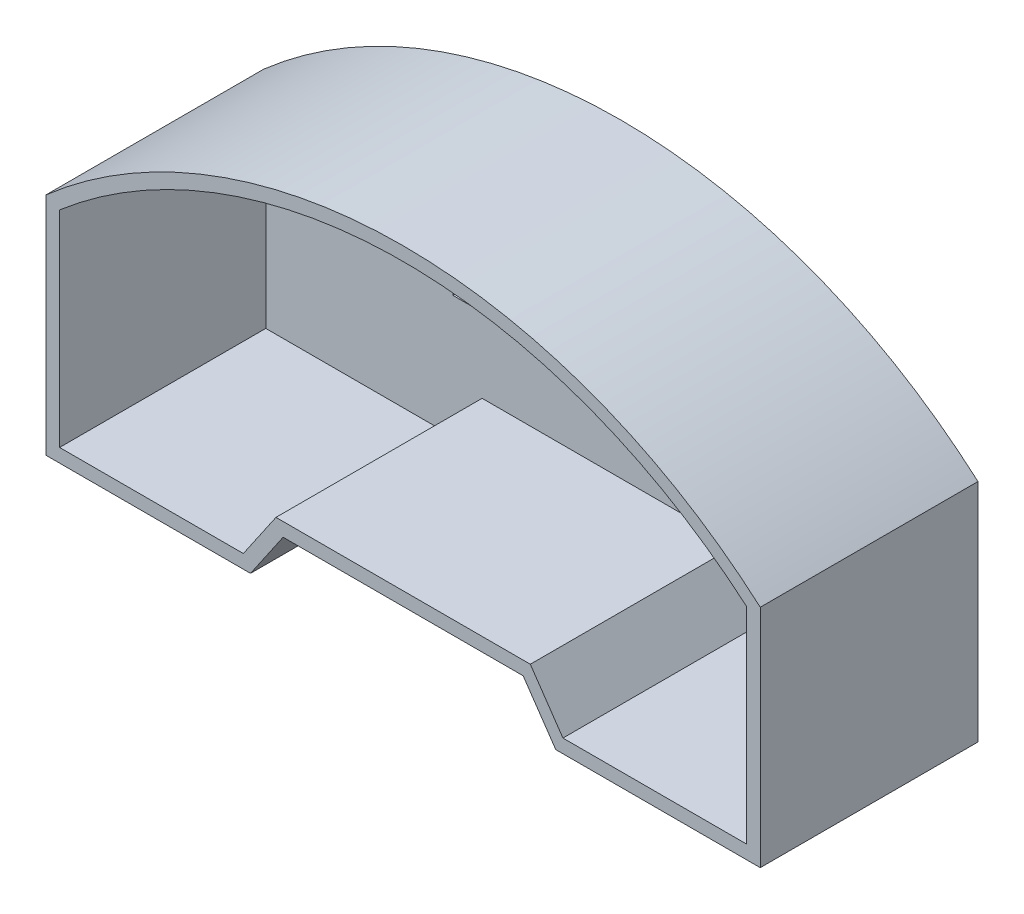
ISO-10303-21;
HEADER;
FILE_DESCRIPTION(('STEP AP214'),'2;1');
FILE_NAME('part.step','',(''),(''),'','','');
FILE_SCHEMA(('AUTOMOTIVE_DESIGN { 1 0 10303 214 1 1 1 1 }'));
ENDSEC;
DATA;
#1=APPLICATION_CONTEXT('core data for automotive mechanical design processes');
#2=APPLICATION_PROTOCOL_DEFINITION('international standard','automotive_design',2000,#1);
#3=PRODUCT_CONTEXT('',#1,'mechanical');
#4=PRODUCT('Part','Part','',(#3));
#5=PRODUCT_RELATED_PRODUCT_CATEGORY('part','',(#4));
#6=PRODUCT_DEFINITION_FORMATION('','',#4);
#7=PRODUCT_DEFINITION_CONTEXT('part definition',#1,'design');
#8=PRODUCT_DEFINITION('design','',#6,#7);
#9=PRODUCT_DEFINITION_SHAPE('','',#8);
#10=(LENGTH_UNIT() NAMED_UNIT(*) SI_UNIT(.MILLI.,.METRE.));
#11=(NAMED_UNIT(*) PLANE_ANGLE_UNIT() SI_UNIT($,.RADIAN.));
#12=(NAMED_UNIT(*) SI_UNIT($,.STERADIAN.) SOLID_ANGLE_UNIT());
#13=UNCERTAINTY_MEASURE_WITH_UNIT(LENGTH_MEASURE(1.E-05),#10,'distance_accuracy_value','');
#14=(GEOMETRIC_REPRESENTATION_CONTEXT(3) GLOBAL_UNCERTAINTY_ASSIGNED_CONTEXT((#13)) GLOBAL_UNIT_ASSIGNED_CONTEXT((#10,
#11,#12)) REPRESENTATION_CONTEXT('',''));
#15=CARTESIAN_POINT('',(0.,0.,0.));
#16=DIRECTION('',(0.,0.,1.));
#17=DIRECTION('',(1.,0.,0.));
#18=AXIS2_PLACEMENT_3D('',#15,#16,#17);
#19=CARTESIAN_POINT('',(230.775246231238,57.6177867906711,2.159));
#20=DIRECTION('',(0.,0.,1.));
#21=DIRECTION('',(1.,0.,0.));
#22=AXIS2_PLACEMENT_3D('',#19,#20,#21);
#23=PLANE('',#22);
#24=DIRECTION('',(1.,0.,0.));
#25=VECTOR('',#24,1.);
#26=CARTESIAN_POINT('',(201.565246231238,116.784020360658,2.159));
#27=LINE('',#26,#25);
#28=CARTESIAN_POINT('',(201.565246231238,116.784020360658,2.159));
#29=VERTEX_POINT('',#28);
#30=CARTESIAN_POINT('',(216.805246231238,116.784020360658,2.159));
#31=VERTEX_POINT('',#30);
#32=EDGE_CURVE('E415',#29,#31,#27,.T.);
#33=ORIENTED_EDGE('',*,*,#32,.F.);
#34=DIRECTION('',(0.,-1.,0.));
#35=VECTOR('',#34,1.);
#36=CARTESIAN_POINT('',(201.565246231238,116.784020360658,2.159));
#37=LINE('',#36,#35);
#38=CARTESIAN_POINT('',(201.565246231238,137.104020360658,2.159));
#39=VERTEX_POINT('',#38);
#40=EDGE_CURVE('E413',#39,#29,#37,.T.);
#41=ORIENTED_EDGE('',*,*,#40,.F.);
#42=DIRECTION('',(-1.,0.,0.));
#43=VECTOR('',#42,1.);
#44=CARTESIAN_POINT('',(201.565246231238,137.104020360658,2.159));
#45=LINE('',#44,#43);
#46=CARTESIAN_POINT('',(216.805246231238,137.104020360658,2.159));
#47=VERTEX_POINT('',#46);
#48=EDGE_CURVE('E421',#47,#39,#45,.T.);
#49=ORIENTED_EDGE('',*,*,#48,.F.);
#50=DIRECTION('',(0.,1.,0.));
#51=VECTOR('',#50,1.);
#52=CARTESIAN_POINT('',(216.805246231238,116.784020360658,2.159));
#53=LINE('',#52,#51);
#54=EDGE_CURVE('E418',#31,#47,#53,.T.);
#55=ORIENTED_EDGE('',*,*,#54,.F.);
#56=EDGE_LOOP('',(#33,#41,#49,#55));
#57=FACE_BOUND('',#56,.T.);
#58=CARTESIAN_POINT('',(230.775246231238,57.6177867906711,2.159));
#59=DIRECTION('',(0.,0.,1.));
#60=DIRECTION('',(1.,0.,0.));
#61=AXIS2_PLACEMENT_3D('',#58,#59,#60);
#62=CIRCLE('',#61,98.4931518246865);
#63=CARTESIAN_POINT('',(294.893472462475,132.382444359074,2.159));
#64=VERTEX_POINT('',#63);
#65=CARTESIAN_POINT('',(166.65702,132.382444359074,2.159));
#66=VERTEX_POINT('',#65);
#67=EDGE_CURVE('E474',#64,#66,#62,.T.);
#68=ORIENTED_EDGE('',*,*,#67,.T.);
#69=DIRECTION('',(0.,-1.,0.));
#70=VECTOR('',#69,1.);
#71=CARTESIAN_POINT('',(166.65702,132.382444359074,2.159));
#72=LINE('',#71,#70);
#73=CARTESIAN_POINT('',(166.65702,93.9799999999996,2.159));
#74=VERTEX_POINT('',#73);
#75=EDGE_CURVE('E477',#66,#74,#72,.T.);
#76=ORIENTED_EDGE('',*,*,#75,.T.);
#77=DIRECTION('',(1.,0.,0.));
#78=VECTOR('',#77,1.);
#79=CARTESIAN_POINT('',(166.65702,93.9799999999996,2.159));
#80=LINE('',#79,#78);
#81=CARTESIAN_POINT('',(200.94702,93.9799999999996,2.159));
#82=VERTEX_POINT('',#81);
#83=EDGE_CURVE('E480',#74,#82,#80,.T.);
#84=ORIENTED_EDGE('',*,*,#83,.T.);
#85=DIRECTION('',(0.565194165260475,0.824957911384281,0.));
#86=VECTOR('',#85,1.);
#87=CARTESIAN_POINT('',(200.94702,93.9799999999996,2.159));
#88=LINE('',#87,#86);
#89=CARTESIAN_POINT('',(207.037726034608,102.87,2.159));
#90=VERTEX_POINT('',#89);
#91=EDGE_CURVE('E483',#82,#90,#88,.T.);
#92=ORIENTED_EDGE('',*,*,#91,.T.);
#93=DIRECTION('',(1.,0.,0.));
#94=VECTOR('',#93,1.);
#95=CARTESIAN_POINT('',(207.037726034608,102.87,2.159));
#96=LINE('',#95,#94);
#97=CARTESIAN_POINT('',(254.512766427868,102.87,2.159));
#98=VERTEX_POINT('',#97);
#99=EDGE_CURVE('E286',#90,#98,#96,.T.);
#100=ORIENTED_EDGE('',*,*,#99,.T.);
#101=DIRECTION('',(0.565194165260474,-0.824957911384281,0.));
#102=VECTOR('',#101,1.);
#103=CARTESIAN_POINT('',(260.603472462475,93.9799999999996,2.159));
#104=LINE('',#103,#102);
#105=CARTESIAN_POINT('',(260.603472462475,93.9799999999996,2.159));
#106=VERTEX_POINT('',#105);
#107=EDGE_CURVE('E486',#98,#106,#104,.T.);
#108=ORIENTED_EDGE('',*,*,#107,.T.);
#109=DIRECTION('',(1.,0.,0.));
#110=VECTOR('',#109,1.);
#111=CARTESIAN_POINT('',(294.893472462475,93.9799999999996,2.159));
#112=LINE('',#111,#110);
#113=CARTESIAN_POINT('',(294.893472462475,93.9799999999996,2.159));
#114=VERTEX_POINT('',#113);
#115=EDGE_CURVE('E89',#106,#114,#112,.T.);
#116=ORIENTED_EDGE('',*,*,#115,.T.);
#117=DIRECTION('',(0.,1.,0.));
#118=VECTOR('',#117,1.);
#119=CARTESIAN_POINT('',(294.893472462475,132.382444359074,2.159));
#120=LINE('',#119,#118);
#121=EDGE_CURVE('E12',#114,#64,#120,.T.);
#122=ORIENTED_EDGE('',*,*,#121,.T.);
#123=EDGE_LOOP('',(#68,#76,#84,#92,#100,#108,#116,#122));
#124=FACE_BOUND('',#123,.T.);
#125=DIRECTION('',(-1.,0.,0.));
#126=VECTOR('',#125,1.);
#127=CARTESIAN_POINT('',(259.985246231238,137.104020360658,2.159));
#128=LINE('',#127,#126);
#129=CARTESIAN_POINT('',(259.985246231238,137.104020360658,2.159));
#130=VERTEX_POINT('',#129);
#131=CARTESIAN_POINT('',(244.745246231238,137.104020360658,2.159));
#132=VERTEX_POINT('',#131);
#133=EDGE_CURVE('E446',#130,#132,#128,.T.);
#134=ORIENTED_EDGE('',*,*,#133,.F.);
#135=DIRECTION('',(0.,1.,0.));
#136=VECTOR('',#135,1.);
#137=CARTESIAN_POINT('',(259.985246231238,116.784020360658,2.159));
#138=LINE('',#137,#136);
#139=CARTESIAN_POINT('',(259.985246231238,116.784020360658,2.159));
#140=VERTEX_POINT('',#139);
#141=EDGE_CURVE('E444',#140,#130,#138,.T.);
#142=ORIENTED_EDGE('',*,*,#141,.F.);
#143=DIRECTION('',(1.,0.,0.));
#144=VECTOR('',#143,1.);
#145=CARTESIAN_POINT('',(259.985246231238,116.784020360658,2.159));
#146=LINE('',#145,#144);
#147=CARTESIAN_POINT('',(244.745246231238,116.784020360658,2.159));
#148=VERTEX_POINT('',#147);
#149=EDGE_CURVE('E452',#148,#140,#146,.T.);
#150=ORIENTED_EDGE('',*,*,#149,.F.);
#151=DIRECTION('',(0.,-1.,0.));
#152=VECTOR('',#151,1.);
#153=CARTESIAN_POINT('',(244.745246231238,116.784020360658,2.159));
#154=LINE('',#153,#152);
#155=EDGE_CURVE('E449',#132,#148,#154,.T.);
#156=ORIENTED_EDGE('',*,*,#155,.F.);
#157=EDGE_LOOP('',(#134,#142,#150,#156));
#158=FACE_BOUND('',#157,.T.);
#159=DIRECTION('',(-1.,0.,0.));
#160=VECTOR('',#159,1.);
#161=CARTESIAN_POINT('',(238.395246231238,137.104020360658,2.159));
#162=LINE('',#161,#160);
#163=CARTESIAN_POINT('',(238.395246231238,137.104020360658,2.159));
#164=VERTEX_POINT('',#163);
#165=CARTESIAN_POINT('',(223.155246231238,137.104020360658,2.159));
#166=VERTEX_POINT('',#165);
#167=EDGE_CURVE('E389',#164,#166,#162,.T.);
#168=ORIENTED_EDGE('',*,*,#167,.F.);
#169=DIRECTION('',(0.,1.,0.));
#170=VECTOR('',#169,1.);
#171=CARTESIAN_POINT('',(238.395246231238,116.784020360658,2.159));
#172=LINE('',#171,#170);
#173=CARTESIAN_POINT('',(238.395246231238,116.784020360658,2.159));
#174=VERTEX_POINT('',#173);
#175=EDGE_CURVE('E387',#174,#164,#172,.T.);
#176=ORIENTED_EDGE('',*,*,#175,.F.);
#177=DIRECTION('',(1.,0.,0.));
#178=VECTOR('',#177,1.);
#179=CARTESIAN_POINT('',(238.395246231238,116.784020360658,2.159));
#180=LINE('',#179,#178);
#181=CARTESIAN_POINT('',(223.155246231238,116.784020360658,2.159));
#182=VERTEX_POINT('',#181);
#183=EDGE_CURVE('E394',#182,#174,#180,.T.);
#184=ORIENTED_EDGE('',*,*,#183,.F.);
#185=DIRECTION('',(0.,-1.,0.));
#186=VECTOR('',#185,1.);
#187=CARTESIAN_POINT('',(223.155246231238,116.784020360658,2.159));
#188=LINE('',#187,#186);
#189=EDGE_CURVE('E392',#166,#182,#188,.T.);
#190=ORIENTED_EDGE('',*,*,#189,.F.);
#191=EDGE_LOOP('',(#168,#176,#184,#190));
#192=FACE_BOUND('',#191,.T.);
#193=ADVANCED_FACE('F81',(#57,#124,#158,#192),#23,.T.);
#194=CARTESIAN_POINT('',(230.775246231238,57.6177867906711,0.));
#195=DIRECTION('',(0.,0.,1.));
#196=DIRECTION('',(1.,0.,0.));
#197=AXIS2_PLACEMENT_3D('',#194,#195,#196);
#198=PLANE('',#197);
#199=DIRECTION('',(0.,-1.,0.));
#200=VECTOR('',#199,1.);
#201=CARTESIAN_POINT('',(201.565246231238,116.784020360658,0.));
#202=LINE('',#201,#200);
#203=CARTESIAN_POINT('',(201.565246231238,137.104020360658,0.));
#204=VERTEX_POINT('',#203);
#205=CARTESIAN_POINT('',(201.565246231238,116.784020360658,0.));
#206=VERTEX_POINT('',#205);
#207=EDGE_CURVE('E412',#204,#206,#202,.T.);
#208=ORIENTED_EDGE('',*,*,#207,.T.);
#209=DIRECTION('',(1.,0.,0.));
#210=VECTOR('',#209,1.);
#211=CARTESIAN_POINT('',(201.565246231238,116.784020360658,0.));
#212=LINE('',#211,#210);
#213=CARTESIAN_POINT('',(216.805246231238,116.784020360658,0.));
#214=VERTEX_POINT('',#213);
#215=EDGE_CURVE('E426',#206,#214,#212,.T.);
#216=ORIENTED_EDGE('',*,*,#215,.T.);
#217=DIRECTION('',(0.,1.,0.));
#218=VECTOR('',#217,1.);
#219=CARTESIAN_POINT('',(216.805246231238,116.784020360658,0.));
#220=LINE('',#219,#218);
#221=CARTESIAN_POINT('',(216.805246231238,137.104020360658,0.));
#222=VERTEX_POINT('',#221);
#223=EDGE_CURVE('E429',#214,#222,#220,.T.);
#224=ORIENTED_EDGE('',*,*,#223,.T.);
#225=DIRECTION('',(-1.,0.,0.));
#226=VECTOR('',#225,1.);
#227=CARTESIAN_POINT('',(201.565246231238,137.104020360658,0.));
#228=LINE('',#227,#226);
#229=EDGE_CURVE('E416',#222,#204,#228,.T.);
#230=ORIENTED_EDGE('',*,*,#229,.T.);
#231=EDGE_LOOP('',(#208,#216,#224,#230));
#232=FACE_BOUND('',#231,.T.);
#233=DIRECTION('',(0.,1.,0.));
#234=VECTOR('',#233,1.);
#235=CARTESIAN_POINT('',(259.985246231238,116.784020360658,0.));
#236=LINE('',#235,#234);
#237=CARTESIAN_POINT('',(259.985246231238,116.784020360658,0.));
#238=VERTEX_POINT('',#237);
#239=CARTESIAN_POINT('',(259.985246231238,137.104020360658,0.));
#240=VERTEX_POINT('',#239);
#241=EDGE_CURVE('E443',#238,#240,#236,.T.);
#242=ORIENTED_EDGE('',*,*,#241,.T.);
#243=DIRECTION('',(-1.,0.,0.));
#244=VECTOR('',#243,1.);
#245=CARTESIAN_POINT('',(259.985246231238,137.104020360658,0.));
#246=LINE('',#245,#244);
#247=CARTESIAN_POINT('',(244.745246231238,137.104020360658,0.));
#248=VERTEX_POINT('',#247);
#249=EDGE_CURVE('E457',#240,#248,#246,.T.);
#250=ORIENTED_EDGE('',*,*,#249,.T.);
#251=DIRECTION('',(0.,-1.,0.));
#252=VECTOR('',#251,1.);
#253=CARTESIAN_POINT('',(244.745246231238,116.784020360658,0.));
#254=LINE('',#253,#252);
#255=CARTESIAN_POINT('',(244.745246231238,116.784020360658,0.));
#256=VERTEX_POINT('',#255);
#257=EDGE_CURVE('E460',#248,#256,#254,.T.);
#258=ORIENTED_EDGE('',*,*,#257,.T.);
#259=DIRECTION('',(1.,0.,0.));
#260=VECTOR('',#259,1.);
#261=CARTESIAN_POINT('',(259.985246231238,116.784020360658,0.));
#262=LINE('',#261,#260);
#263=EDGE_CURVE('E447',#256,#238,#262,.T.);
#264=ORIENTED_EDGE('',*,*,#263,.T.);
#265=EDGE_LOOP('',(#242,#250,#258,#264));
#266=FACE_BOUND('',#265,.T.);
#267=DIRECTION('',(0.,1.,0.));
#268=VECTOR('',#267,1.);
#269=CARTESIAN_POINT('',(238.395246231238,116.784020360658,0.));
#270=LINE('',#269,#268);
#271=CARTESIAN_POINT('',(238.395246231238,116.784020360658,0.));
#272=VERTEX_POINT('',#271);
#273=CARTESIAN_POINT('',(238.395246231238,137.104020360658,0.));
#274=VERTEX_POINT('',#273);
#275=EDGE_CURVE('E104',#272,#274,#270,.T.);
#276=ORIENTED_EDGE('',*,*,#275,.T.);
#277=DIRECTION('',(-1.,0.,0.));
#278=VECTOR('',#277,1.);
#279=CARTESIAN_POINT('',(238.395246231238,137.104020360658,0.));
#280=LINE('',#279,#278);
#281=CARTESIAN_POINT('',(223.155246231238,137.104020360658,0.));
#282=VERTEX_POINT('',#281);
#283=EDGE_CURVE('E398',#274,#282,#280,.T.);
#284=ORIENTED_EDGE('',*,*,#283,.T.);
#285=DIRECTION('',(0.,-1.,0.));
#286=VECTOR('',#285,1.);
#287=CARTESIAN_POINT('',(223.155246231238,116.784020360658,0.));
#288=LINE('',#287,#286);
#289=CARTESIAN_POINT('',(223.155246231238,116.784020360658,0.));
#290=VERTEX_POINT('',#289);
#291=EDGE_CURVE('E401',#282,#290,#288,.T.);
#292=ORIENTED_EDGE('',*,*,#291,.T.);
#293=DIRECTION('',(1.,0.,0.));
#294=VECTOR('',#293,1.);
#295=CARTESIAN_POINT('',(238.395246231238,116.784020360658,0.));
#296=LINE('',#295,#294);
#297=EDGE_CURVE('E390',#290,#272,#296,.T.);
#298=ORIENTED_EDGE('',*,*,#297,.T.);
#299=EDGE_LOOP('',(#276,#284,#292,#298));
#300=FACE_BOUND('',#299,.T.);
#301=DIRECTION('',(0.565194165260475,0.824957911384281,0.));
#302=VECTOR('',#301,1.);
#303=CARTESIAN_POINT('',(203.042413094916,92.544406820238,0.));
#304=LINE('',#303,#302);
#305=CARTESIAN_POINT('',(202.285763231622,91.4399999999996,0.));
#306=VERTEX_POINT('',#305);
#307=CARTESIAN_POINT('',(208.376469266229,100.33,0.));
#308=VERTEX_POINT('',#307);
#309=EDGE_CURVE('E287',#306,#308,#304,.T.);
#310=ORIENTED_EDGE('',*,*,#309,.F.);
#311=DIRECTION('',(1.,0.,0.));
#312=VECTOR('',#311,1.);
#313=CARTESIAN_POINT('',(166.65702,91.4399999999996,0.));
#314=LINE('',#313,#312);
#315=CARTESIAN_POINT('',(164.11702,91.4399999999996,0.));
#316=VERTEX_POINT('',#315);
#317=EDGE_CURVE('E331',#316,#306,#314,.T.);
#318=ORIENTED_EDGE('',*,*,#317,.F.);
#319=DIRECTION('',(0.,-1.,0.));
#320=VECTOR('',#319,1.);
#321=CARTESIAN_POINT('',(164.11702,132.382444359074,0.));
#322=LINE('',#321,#320);
#323=CARTESIAN_POINT('',(164.11702,133.541292000423,0.));
#324=VERTEX_POINT('',#323);
#325=EDGE_CURVE('E365',#324,#316,#322,.T.);
#326=ORIENTED_EDGE('',*,*,#325,.F.);
#327=CARTESIAN_POINT('',(230.775246231238,57.6177867906711,0.));
#328=DIRECTION('',(0.,0.,1.));
#329=DIRECTION('',(1.,0.,0.));
#330=AXIS2_PLACEMENT_3D('',#327,#328,#329);
#331=CIRCLE('',#330,101.033151824686);
#332=CARTESIAN_POINT('',(297.433472462475,133.541292000423,0.));
#333=VERTEX_POINT('',#332);
#334=EDGE_CURVE('E363',#333,#324,#331,.T.);
#335=ORIENTED_EDGE('',*,*,#334,.F.);
#336=DIRECTION('',(0.,-1.,0.));
#337=VECTOR('',#336,1.);
#338=CARTESIAN_POINT('',(297.433472462475,132.382444359074,0.));
#339=LINE('',#338,#337);
#340=CARTESIAN_POINT('',(297.433472462475,91.4399999999996,0.));
#341=VERTEX_POINT('',#340);
#342=EDGE_CURVE('E360',#333,#341,#339,.T.);
#343=ORIENTED_EDGE('',*,*,#342,.T.);
#344=DIRECTION('',(-1.,0.,0.));
#345=VECTOR('',#344,1.);
#346=CARTESIAN_POINT('',(294.893472462475,91.4399999999996,0.));
#347=LINE('',#346,#345);
#348=CARTESIAN_POINT('',(259.264729230854,91.4399999999996,0.));
#349=VERTEX_POINT('',#348);
#350=EDGE_CURVE('E357',#341,#349,#347,.T.);
#351=ORIENTED_EDGE('',*,*,#350,.T.);
#352=DIRECTION('',(-0.565194165260474,0.824957911384282,0.));
#353=VECTOR('',#352,1.);
#354=CARTESIAN_POINT('',(258.508079367559,92.544406820238,0.));
#355=LINE('',#354,#353);
#356=CARTESIAN_POINT('',(253.174023196246,100.33,0.));
#357=VERTEX_POINT('',#356);
#358=EDGE_CURVE('E354',#349,#357,#355,.T.);
#359=ORIENTED_EDGE('',*,*,#358,.T.);
#360=DIRECTION('',(1.,0.,0.));
#361=VECTOR('',#360,1.);
#362=CARTESIAN_POINT('',(207.037726034608,100.33,0.));
#363=LINE('',#362,#361);
#364=EDGE_CURVE('E351',#308,#357,#363,.T.);
#365=ORIENTED_EDGE('',*,*,#364,.F.);
#366=EDGE_LOOP('',(#310,#318,#326,#335,#343,#351,#359,#365));
#367=FACE_BOUND('',#366,.T.);
#368=ADVANCED_FACE('F83',(#232,#266,#300,#367),#198,.F.);
#369=CARTESIAN_POINT('',(259.985246231238,116.784020360658,2.159));
#370=DIRECTION('',(-1.,0.,0.));
#371=DIRECTION('',(0.,-1.,0.));
#372=AXIS2_PLACEMENT_3D('',#369,#370,#371);
#373=PLANE('',#372);
#374=ORIENTED_EDGE('',*,*,#241,.F.);
#375=DIRECTION('',(0.,0.,-1.));
#376=VECTOR('',#375,1.);
#377=CARTESIAN_POINT('',(259.985246231238,116.784020360658,2.159));
#378=LINE('',#377,#376);
#379=EDGE_CURVE('E454',#140,#238,#378,.T.);
#380=ORIENTED_EDGE('',*,*,#379,.F.);
#381=ORIENTED_EDGE('',*,*,#141,.T.);
#382=DIRECTION('',(0.,0.,-1.));
#383=VECTOR('',#382,1.);
#384=CARTESIAN_POINT('',(259.985246231238,137.104020360658,2.159));
#385=LINE('',#384,#383);
#386=EDGE_CURVE('E471',#130,#240,#385,.T.);
#387=ORIENTED_EDGE('',*,*,#386,.T.);
#388=EDGE_LOOP('',(#374,#380,#381,#387));
#389=FACE_BOUND('',#388,.T.);
#390=ADVANCED_FACE('F519',(#389),#373,.T.);
#391=CARTESIAN_POINT('',(259.985246231238,137.104020360658,2.159));
#392=DIRECTION('',(0.,-1.,0.));
#393=DIRECTION('',(0.,0.,-1.));
#394=AXIS2_PLACEMENT_3D('',#391,#392,#393);
#395=PLANE('',#394);
#396=ORIENTED_EDGE('',*,*,#249,.F.);
#397=ORIENTED_EDGE('',*,*,#386,.F.);
#398=ORIENTED_EDGE('',*,*,#133,.T.);
#399=DIRECTION('',(0.,0.,-1.));
#400=VECTOR('',#399,1.);
#401=CARTESIAN_POINT('',(244.745246231238,137.104020360658,2.159));
#402=LINE('',#401,#400);
#403=EDGE_CURVE('E469',#132,#248,#402,.T.);
#404=ORIENTED_EDGE('',*,*,#403,.T.);
#405=EDGE_LOOP('',(#396,#397,#398,#404));
#406=FACE_BOUND('',#405,.T.);
#407=ADVANCED_FACE('F525',(#406),#395,.T.);
#408=CARTESIAN_POINT('',(244.745246231238,116.784020360658,2.159));
#409=DIRECTION('',(1.,0.,0.));
#410=DIRECTION('',(0.,0.,-1.));
#411=AXIS2_PLACEMENT_3D('',#408,#409,#410);
#412=PLANE('',#411);
#413=ORIENTED_EDGE('',*,*,#257,.F.);
#414=ORIENTED_EDGE('',*,*,#403,.F.);
#415=ORIENTED_EDGE('',*,*,#155,.T.);
#416=DIRECTION('',(0.,0.,-1.));
#417=VECTOR('',#416,1.);
#418=CARTESIAN_POINT('',(244.745246231238,116.784020360658,2.159));
#419=LINE('',#418,#417);
#420=EDGE_CURVE('E467',#148,#256,#419,.T.);
#421=ORIENTED_EDGE('',*,*,#420,.T.);
#422=EDGE_LOOP('',(#413,#414,#415,#421));
#423=FACE_BOUND('',#422,.T.);
#424=ADVANCED_FACE('F529',(#423),#412,.T.);
#425=CARTESIAN_POINT('',(259.985246231238,116.784020360658,2.159));
#426=DIRECTION('',(0.,1.,0.));
#427=DIRECTION('',(0.,0.,1.));
#428=AXIS2_PLACEMENT_3D('',#425,#426,#427);
#429=PLANE('',#428);
#430=ORIENTED_EDGE('',*,*,#263,.F.);
#431=ORIENTED_EDGE('',*,*,#420,.F.);
#432=ORIENTED_EDGE('',*,*,#149,.T.);
#433=ORIENTED_EDGE('',*,*,#379,.T.);
#434=EDGE_LOOP('',(#430,#431,#432,#433));
#435=FACE_BOUND('',#434,.T.);
#436=ADVANCED_FACE('F533',(#435),#429,.T.);
#437=CARTESIAN_POINT('',(201.565246231238,116.784020360658,2.159));
#438=DIRECTION('',(1.,0.,0.));
#439=DIRECTION('',(0.,1.,0.));
#440=AXIS2_PLACEMENT_3D('',#437,#438,#439);
#441=PLANE('',#440);
#442=ORIENTED_EDGE('',*,*,#207,.F.);
#443=DIRECTION('',(0.,0.,-1.));
#444=VECTOR('',#443,1.);
#445=CARTESIAN_POINT('',(201.565246231238,137.104020360658,2.159));
#446=LINE('',#445,#444);
#447=EDGE_CURVE('E423',#39,#204,#446,.T.);
#448=ORIENTED_EDGE('',*,*,#447,.F.);
#449=ORIENTED_EDGE('',*,*,#40,.T.);
#450=DIRECTION('',(0.,0.,-1.));
#451=VECTOR('',#450,1.);
#452=CARTESIAN_POINT('',(201.565246231238,116.784020360658,2.159));
#453=LINE('',#452,#451);
#454=EDGE_CURVE('E440',#29,#206,#453,.T.);
#455=ORIENTED_EDGE('',*,*,#454,.T.);
#456=EDGE_LOOP('',(#442,#448,#449,#455));
#457=FACE_BOUND('',#456,.T.);
#458=ADVANCED_FACE('F537',(#457),#441,.T.);
#459=CARTESIAN_POINT('',(201.565246231238,116.784020360658,2.159));
#460=DIRECTION('',(0.,1.,0.));
#461=DIRECTION('',(-1.,0.,0.));
#462=AXIS2_PLACEMENT_3D('',#459,#460,#461);
#463=PLANE('',#462);
#464=ORIENTED_EDGE('',*,*,#215,.F.);
#465=ORIENTED_EDGE('',*,*,#454,.F.);
#466=ORIENTED_EDGE('',*,*,#32,.T.);
#467=DIRECTION('',(0.,0.,-1.));
#468=VECTOR('',#467,1.);
#469=CARTESIAN_POINT('',(216.805246231238,116.784020360658,2.159));
#470=LINE('',#469,#468);
#471=EDGE_CURVE('E438',#31,#214,#470,.T.);
#472=ORIENTED_EDGE('',*,*,#471,.T.);
#473=EDGE_LOOP('',(#464,#465,#466,#472));
#474=FACE_BOUND('',#473,.T.);
#475=ADVANCED_FACE('F541',(#474),#463,.T.);
#476=CARTESIAN_POINT('',(216.805246231238,116.784020360658,2.159));
#477=DIRECTION('',(-1.,0.,0.));
#478=DIRECTION('',(0.,0.,1.));
#479=AXIS2_PLACEMENT_3D('',#476,#477,#478);
#480=PLANE('',#479);
#481=ORIENTED_EDGE('',*,*,#223,.F.);
#482=ORIENTED_EDGE('',*,*,#471,.F.);
#483=ORIENTED_EDGE('',*,*,#54,.T.);
#484=DIRECTION('',(0.,0.,-1.));
#485=VECTOR('',#484,1.);
#486=CARTESIAN_POINT('',(216.805246231238,137.104020360658,2.159));
#487=LINE('',#486,#485);
#488=EDGE_CURVE('E436',#47,#222,#487,.T.);
#489=ORIENTED_EDGE('',*,*,#488,.T.);
#490=EDGE_LOOP('',(#481,#482,#483,#489));
#491=FACE_BOUND('',#490,.T.);
#492=ADVANCED_FACE('F545',(#491),#480,.T.);
#493=CARTESIAN_POINT('',(201.565246231238,137.104020360658,2.159));
#494=DIRECTION('',(0.,-1.,0.));
#495=DIRECTION('',(0.,0.,-1.));
#496=AXIS2_PLACEMENT_3D('',#493,#494,#495);
#497=PLANE('',#496);
#498=ORIENTED_EDGE('',*,*,#229,.F.);
#499=ORIENTED_EDGE('',*,*,#488,.F.);
#500=ORIENTED_EDGE('',*,*,#48,.T.);
#501=ORIENTED_EDGE('',*,*,#447,.T.);
#502=EDGE_LOOP('',(#498,#499,#500,#501));
#503=FACE_BOUND('',#502,.T.);
#504=ADVANCED_FACE('F549',(#503),#497,.T.);
#505=CARTESIAN_POINT('',(238.395246231238,116.784020360658,2.159));
#506=DIRECTION('',(-1.,0.,0.));
#507=DIRECTION('',(0.,0.,1.));
#508=AXIS2_PLACEMENT_3D('',#505,#506,#507);
#509=PLANE('',#508);
#510=ORIENTED_EDGE('',*,*,#275,.F.);
#511=DIRECTION('',(0.,0.,-1.));
#512=VECTOR('',#511,1.);
#513=CARTESIAN_POINT('',(238.395246231238,116.784020360658,2.159));
#514=LINE('',#513,#512);
#515=EDGE_CURVE('E396',#174,#272,#514,.T.);
#516=ORIENTED_EDGE('',*,*,#515,.F.);
#517=ORIENTED_EDGE('',*,*,#175,.T.);
#518=DIRECTION('',(0.,0.,-1.));
#519=VECTOR('',#518,1.);
#520=CARTESIAN_POINT('',(238.395246231238,137.104020360658,2.159));
#521=LINE('',#520,#519);
#522=EDGE_CURVE('E410',#164,#274,#521,.T.);
#523=ORIENTED_EDGE('',*,*,#522,.T.);
#524=EDGE_LOOP('',(#510,#516,#517,#523));
#525=FACE_BOUND('',#524,.T.);
#526=ADVANCED_FACE('F553',(#525),#509,.T.);
#527=CARTESIAN_POINT('',(238.395246231238,137.104020360658,2.159));
#528=DIRECTION('',(0.,-1.,0.));
#529=DIRECTION('',(0.,0.,-1.));
#530=AXIS2_PLACEMENT_3D('',#527,#528,#529);
#531=PLANE('',#530);
#532=ORIENTED_EDGE('',*,*,#283,.F.);
#533=ORIENTED_EDGE('',*,*,#522,.F.);
#534=ORIENTED_EDGE('',*,*,#167,.T.);
#535=DIRECTION('',(0.,0.,-1.));
#536=VECTOR('',#535,1.);
#537=CARTESIAN_POINT('',(223.155246231238,137.104020360658,2.159));
#538=LINE('',#537,#536);
#539=EDGE_CURVE('E408',#166,#282,#538,.T.);
#540=ORIENTED_EDGE('',*,*,#539,.T.);
#541=EDGE_LOOP('',(#532,#533,#534,#540));
#542=FACE_BOUND('',#541,.T.);
#543=ADVANCED_FACE('F557',(#542),#531,.T.);
#544=CARTESIAN_POINT('',(223.155246231238,116.784020360658,2.159));
#545=DIRECTION('',(1.,0.,0.));
#546=DIRECTION('',(0.,0.,-1.));
#547=AXIS2_PLACEMENT_3D('',#544,#545,#546);
#548=PLANE('',#547);
#549=ORIENTED_EDGE('',*,*,#291,.F.);
#550=ORIENTED_EDGE('',*,*,#539,.F.);
#551=ORIENTED_EDGE('',*,*,#189,.T.);
#552=DIRECTION('',(0.,0.,-1.));
#553=VECTOR('',#552,1.);
#554=CARTESIAN_POINT('',(223.155246231238,116.784020360658,2.159));
#555=LINE('',#554,#553);
#556=EDGE_CURVE('E96',#182,#290,#555,.T.);
#557=ORIENTED_EDGE('',*,*,#556,.T.);
#558=EDGE_LOOP('',(#549,#550,#551,#557));
#559=FACE_BOUND('',#558,.T.);
#560=ADVANCED_FACE('F560',(#559),#548,.T.);
#561=CARTESIAN_POINT('',(238.395246231238,116.784020360658,2.159));
#562=DIRECTION('',(0.,1.,0.));
#563=DIRECTION('',(0.,0.,1.));
#564=AXIS2_PLACEMENT_3D('',#561,#562,#563);
#565=PLANE('',#564);
#566=ORIENTED_EDGE('',*,*,#297,.F.);
#567=ORIENTED_EDGE('',*,*,#556,.F.);
#568=ORIENTED_EDGE('',*,*,#183,.T.);
#569=ORIENTED_EDGE('',*,*,#515,.T.);
#570=EDGE_LOOP('',(#566,#567,#568,#569));
#571=FACE_BOUND('',#570,.T.);
#572=ADVANCED_FACE('F564',(#571),#565,.T.);
#573=CARTESIAN_POINT('',(230.775246231238,57.6177867906711,40.64));
#574=DIRECTION('',(0.,0.,1.));
#575=DIRECTION('',(1.,0.,0.));
#576=AXIS2_PLACEMENT_3D('',#573,#574,#575);
#577=PLANE('',#576);
#578=DIRECTION('',(0.565194165260475,0.824957911384281,0.));
#579=VECTOR('',#578,1.);
#580=CARTESIAN_POINT('',(203.042413094916,92.544406820238,40.64));
#581=LINE('',#580,#579);
#582=CARTESIAN_POINT('',(202.285763231622,91.4399999999996,40.64));
#583=VERTEX_POINT('',#582);
#584=CARTESIAN_POINT('',(208.376469266229,100.33,40.64));
#585=VERTEX_POINT('',#584);
#586=EDGE_CURVE('E327',#583,#585,#581,.T.);
#587=ORIENTED_EDGE('',*,*,#586,.T.);
#588=DIRECTION('',(1.,0.,0.));
#589=VECTOR('',#588,1.);
#590=CARTESIAN_POINT('',(207.037726034608,100.33,40.64));
#591=LINE('',#590,#589);
#592=CARTESIAN_POINT('',(253.174023196246,100.33,40.64));
#593=VERTEX_POINT('',#592);
#594=EDGE_CURVE('E330',#585,#593,#591,.T.);
#595=ORIENTED_EDGE('',*,*,#594,.T.);
#596=DIRECTION('',(-0.565194165260474,0.824957911384282,0.));
#597=VECTOR('',#596,1.);
#598=CARTESIAN_POINT('',(258.508079367559,92.544406820238,40.64));
#599=LINE('',#598,#597);
#600=CARTESIAN_POINT('',(259.264729230854,91.4399999999996,40.64));
#601=VERTEX_POINT('',#600);
#602=EDGE_CURVE('E333',#601,#593,#599,.T.);
#603=ORIENTED_EDGE('',*,*,#602,.F.);
#604=DIRECTION('',(-1.,0.,0.));
#605=VECTOR('',#604,1.);
#606=CARTESIAN_POINT('',(294.893472462475,91.4399999999996,40.64));
#607=LINE('',#606,#605);
#608=CARTESIAN_POINT('',(297.433472462475,91.4399999999996,40.64));
#609=VERTEX_POINT('',#608);
#610=EDGE_CURVE('E336',#609,#601,#607,.T.);
#611=ORIENTED_EDGE('',*,*,#610,.F.);
#612=DIRECTION('',(0.,-1.,0.));
#613=VECTOR('',#612,1.);
#614=CARTESIAN_POINT('',(297.433472462475,132.382444359074,40.64));
#615=LINE('',#614,#613);
#616=CARTESIAN_POINT('',(297.433472462475,133.541292000423,40.64));
#617=VERTEX_POINT('',#616);
#618=EDGE_CURVE('E339',#617,#609,#615,.T.);
#619=ORIENTED_EDGE('',*,*,#618,.F.);
#620=CARTESIAN_POINT('',(230.775246231238,57.6177867906711,40.64));
#621=DIRECTION('',(0.,0.,1.));
#622=DIRECTION('',(1.,0.,0.));
#623=AXIS2_PLACEMENT_3D('',#620,#621,#622);
#624=CIRCLE('',#623,101.033151824686);
#625=CARTESIAN_POINT('',(164.11702,133.541292000423,40.64));
#626=VERTEX_POINT('',#625);
#627=EDGE_CURVE('E342',#617,#626,#624,.T.);
#628=ORIENTED_EDGE('',*,*,#627,.T.);
#629=DIRECTION('',(0.,-1.,0.));
#630=VECTOR('',#629,1.);
#631=CARTESIAN_POINT('',(164.11702,132.382444359074,40.64));
#632=LINE('',#631,#630);
#633=CARTESIAN_POINT('',(164.11702,91.4399999999996,40.64));
#634=VERTEX_POINT('',#633);
#635=EDGE_CURVE('E344',#626,#634,#632,.T.);
#636=ORIENTED_EDGE('',*,*,#635,.T.);
#637=DIRECTION('',(1.,0.,0.));
#638=VECTOR('',#637,1.);
#639=CARTESIAN_POINT('',(166.65702,91.4399999999996,40.64));
#640=LINE('',#639,#638);
#641=EDGE_CURVE('E346',#634,#583,#640,.T.);
#642=ORIENTED_EDGE('',*,*,#641,.T.);
#643=EDGE_LOOP('',(#587,#595,#603,#611,#619,#628,#636,#642));
#644=FACE_BOUND('',#643,.T.);
#645=DIRECTION('',(1.,0.,0.));
#646=VECTOR('',#645,1.);
#647=CARTESIAN_POINT('',(207.037726034608,102.87,40.64));
#648=LINE('',#647,#646);
#649=CARTESIAN_POINT('',(207.037726034608,102.87,40.64));
#650=VERTEX_POINT('',#649);
#651=CARTESIAN_POINT('',(254.512766427868,102.87,40.64));
#652=VERTEX_POINT('',#651);
#653=EDGE_CURVE('E279',#650,#652,#648,.T.);
#654=ORIENTED_EDGE('',*,*,#653,.F.);
#655=DIRECTION('',(0.565194165260475,0.824957911384281,0.));
#656=VECTOR('',#655,1.);
#657=CARTESIAN_POINT('',(200.94702,93.9799999999996,40.64));
#658=LINE('',#657,#656);
#659=CARTESIAN_POINT('',(200.94702,93.9799999999996,40.64));
#660=VERTEX_POINT('',#659);
#661=EDGE_CURVE('E269',#660,#650,#658,.T.);
#662=ORIENTED_EDGE('',*,*,#661,.F.);
#663=DIRECTION('',(1.,0.,0.));
#664=VECTOR('',#663,1.);
#665=CARTESIAN_POINT('',(166.65702,93.9799999999996,40.64));
#666=LINE('',#665,#664);
#667=CARTESIAN_POINT('',(166.65702,93.9799999999996,40.64));
#668=VERTEX_POINT('',#667);
#669=EDGE_CURVE('E308',#668,#660,#666,.T.);
#670=ORIENTED_EDGE('',*,*,#669,.F.);
#671=DIRECTION('',(0.,-1.,0.));
#672=VECTOR('',#671,1.);
#673=CARTESIAN_POINT('',(166.65702,132.382444359074,40.64));
#674=LINE('',#673,#672);
#675=CARTESIAN_POINT('',(166.65702,132.382444359074,40.64));
#676=VERTEX_POINT('',#675);
#677=EDGE_CURVE('E305',#676,#668,#674,.T.);
#678=ORIENTED_EDGE('',*,*,#677,.F.);
#679=CARTESIAN_POINT('',(230.775246231238,57.6177867906711,40.64));
#680=DIRECTION('',(0.,0.,1.));
#681=DIRECTION('',(1.,0.,0.));
#682=AXIS2_PLACEMENT_3D('',#679,#680,#681);
#683=CIRCLE('',#682,98.4931518246865);
#684=CARTESIAN_POINT('',(294.893472462475,132.382444359074,40.64));
#685=VERTEX_POINT('',#684);
#686=EDGE_CURVE('E303',#685,#676,#683,.T.);
#687=ORIENTED_EDGE('',*,*,#686,.F.);
#688=DIRECTION('',(0.,-1.,0.));
#689=VECTOR('',#688,1.);
#690=CARTESIAN_POINT('',(294.893472462475,132.382444359074,40.64));
#691=LINE('',#690,#689);
#692=CARTESIAN_POINT('',(294.893472462475,93.9799999999996,40.64));
#693=VERTEX_POINT('',#692);
#694=EDGE_CURVE('E300',#685,#693,#691,.T.);
#695=ORIENTED_EDGE('',*,*,#694,.T.);
#696=DIRECTION('',(-1.,0.,0.));
#697=VECTOR('',#696,1.);
#698=CARTESIAN_POINT('',(294.893472462475,93.9799999999996,40.64));
#699=LINE('',#698,#697);
#700=CARTESIAN_POINT('',(260.603472462475,93.9799999999996,40.64));
#701=VERTEX_POINT('',#700);
#702=EDGE_CURVE('E296',#693,#701,#699,.T.);
#703=ORIENTED_EDGE('',*,*,#702,.T.);
#704=DIRECTION('',(-0.565194165260474,0.824957911384281,0.));
#705=VECTOR('',#704,1.);
#706=CARTESIAN_POINT('',(260.603472462475,93.9799999999996,40.64));
#707=LINE('',#706,#705);
#708=EDGE_CURVE('E294',#701,#652,#707,.T.);
#709=ORIENTED_EDGE('',*,*,#708,.T.);
#710=EDGE_LOOP('',(#654,#662,#670,#678,#687,#695,#703,#709));
#711=FACE_BOUND('',#710,.T.);
#712=ADVANCED_FACE('F291',(#644,#711),#577,.T.);
#713=CARTESIAN_POINT('',(203.042413094916,92.544406820238,40.64));
#714=DIRECTION('',(-0.824957911384281,0.565194165260475,0.));
#715=DIRECTION('',(-0.565194165260475,-0.824957911384281,0.));
#716=AXIS2_PLACEMENT_3D('',#713,#714,#715);
#717=PLANE('',#716);
#718=ORIENTED_EDGE('',*,*,#309,.T.);
#719=DIRECTION('',(0.,0.,-1.));
#720=VECTOR('',#719,1.);
#721=CARTESIAN_POINT('',(208.376469266229,100.33,40.64));
#722=LINE('',#721,#720);
#723=EDGE_CURVE('E384',#585,#308,#722,.T.);
#724=ORIENTED_EDGE('',*,*,#723,.F.);
#725=ORIENTED_EDGE('',*,*,#586,.F.);
#726=DIRECTION('',(0.,0.,-1.));
#727=VECTOR('',#726,1.);
#728=CARTESIAN_POINT('',(202.285763231622,91.4399999999996,40.64));
#729=LINE('',#728,#727);
#730=EDGE_CURVE('E348',#583,#306,#729,.T.);
#731=ORIENTED_EDGE('',*,*,#730,.T.);
#732=EDGE_LOOP('',(#718,#724,#725,#731));
#733=FACE_BOUND('',#732,.T.);
#734=ADVANCED_FACE('F568',(#733),#717,.F.);
#735=CARTESIAN_POINT('',(207.037726034608,100.33,40.64));
#736=DIRECTION('',(0.,1.,0.));
#737=DIRECTION('',(0.,0.,1.));
#738=AXIS2_PLACEMENT_3D('',#735,#736,#737);
#739=PLANE('',#738);
#740=ORIENTED_EDGE('',*,*,#364,.T.);
#741=DIRECTION('',(0.,0.,-1.));
#742=VECTOR('',#741,1.);
#743=CARTESIAN_POINT('',(253.174023196246,100.33,40.64));
#744=LINE('',#743,#742);
#745=EDGE_CURVE('E382',#593,#357,#744,.T.);
#746=ORIENTED_EDGE('',*,*,#745,.F.);
#747=ORIENTED_EDGE('',*,*,#594,.F.);
#748=ORIENTED_EDGE('',*,*,#723,.T.);
#749=EDGE_LOOP('',(#740,#746,#747,#748));
#750=FACE_BOUND('',#749,.T.);
#751=ADVANCED_FACE('F571',(#750),#739,.F.);
#752=CARTESIAN_POINT('',(258.508079367559,92.544406820238,40.64));
#753=DIRECTION('',(-0.824957911384281,-0.565194165260474,0.));
#754=DIRECTION('',(0.565194165260474,-0.824957911384282,0.));
#755=AXIS2_PLACEMENT_3D('',#752,#753,#754);
#756=PLANE('',#755);
#757=ORIENTED_EDGE('',*,*,#358,.F.);
#758=DIRECTION('',(0.,0.,-1.));
#759=VECTOR('',#758,1.);
#760=CARTESIAN_POINT('',(259.264729230854,91.4399999999996,40.64));
#761=LINE('',#760,#759);
#762=EDGE_CURVE('E380',#601,#349,#761,.T.);
#763=ORIENTED_EDGE('',*,*,#762,.F.);
#764=ORIENTED_EDGE('',*,*,#602,.T.);
#765=ORIENTED_EDGE('',*,*,#745,.T.);
#766=EDGE_LOOP('',(#757,#763,#764,#765));
#767=FACE_BOUND('',#766,.T.);
#768=ADVANCED_FACE('F575',(#767),#756,.T.);
#769=CARTESIAN_POINT('',(294.893472462475,91.4399999999996,40.64));
#770=DIRECTION('',(0.,-1.,0.));
#771=DIRECTION('',(0.,0.,-1.));
#772=AXIS2_PLACEMENT_3D('',#769,#770,#771);
#773=PLANE('',#772);
#774=ORIENTED_EDGE('',*,*,#350,.F.);
#775=DIRECTION('',(0.,0.,-1.));
#776=VECTOR('',#775,1.);
#777=CARTESIAN_POINT('',(297.433472462475,91.4399999999996,40.64));
#778=LINE('',#777,#776);
#779=EDGE_CURVE('E378',#609,#341,#778,.T.);
#780=ORIENTED_EDGE('',*,*,#779,.F.);
#781=ORIENTED_EDGE('',*,*,#610,.T.);
#782=ORIENTED_EDGE('',*,*,#762,.T.);
#783=EDGE_LOOP('',(#774,#780,#781,#782));
#784=FACE_BOUND('',#783,.T.);
#785=ADVANCED_FACE('F579',(#784),#773,.T.);
#786=CARTESIAN_POINT('',(297.433472462475,132.382444359074,40.64));
#787=DIRECTION('',(1.,0.,0.));
#788=DIRECTION('',(0.,1.,0.));
#789=AXIS2_PLACEMENT_3D('',#786,#787,#788);
#790=PLANE('',#789);
#791=ORIENTED_EDGE('',*,*,#342,.F.);
#792=DIRECTION('',(0.,0.,-1.));
#793=VECTOR('',#792,1.);
#794=CARTESIAN_POINT('',(297.433472462475,133.541292000423,40.64));
#795=LINE('',#794,#793);
#796=EDGE_CURVE('E376',#617,#333,#795,.T.);
#797=ORIENTED_EDGE('',*,*,#796,.F.);
#798=ORIENTED_EDGE('',*,*,#618,.T.);
#799=ORIENTED_EDGE('',*,*,#779,.T.);
#800=EDGE_LOOP('',(#791,#797,#798,#799));
#801=FACE_BOUND('',#800,.T.);
#802=ADVANCED_FACE('F583',(#801),#790,.T.);
#803=CARTESIAN_POINT('',(230.775246231238,57.6177867906711,40.64));
#804=DIRECTION('',(0.,0.,-1.));
#805=DIRECTION('',(-1.,0.,0.));
#806=AXIS2_PLACEMENT_3D('',#803,#804,#805);
#807=CYLINDRICAL_SURFACE('',#806,101.033151824686);
#808=ORIENTED_EDGE('',*,*,#334,.T.);
#809=DIRECTION('',(0.,0.,-1.));
#810=VECTOR('',#809,1.);
#811=CARTESIAN_POINT('',(164.11702,133.541292000423,40.64));
#812=LINE('',#811,#810);
#813=EDGE_CURVE('E373',#626,#324,#812,.T.);
#814=ORIENTED_EDGE('',*,*,#813,.F.);
#815=ORIENTED_EDGE('',*,*,#627,.F.);
#816=ORIENTED_EDGE('',*,*,#796,.T.);
#817=EDGE_LOOP('',(#808,#814,#815,#816));
#818=FACE_BOUND('',#817,.T.);
#819=ADVANCED_FACE('F587',(#818),#807,.T.);
#820=CARTESIAN_POINT('',(164.11702,132.382444359074,40.64));
#821=DIRECTION('',(1.,0.,0.));
#822=DIRECTION('',(0.,1.,0.));
#823=AXIS2_PLACEMENT_3D('',#820,#821,#822);
#824=PLANE('',#823);
#825=ORIENTED_EDGE('',*,*,#325,.T.);
#826=DIRECTION('',(0.,0.,-1.));
#827=VECTOR('',#826,1.);
#828=CARTESIAN_POINT('',(164.11702,91.4399999999996,40.64));
#829=LINE('',#828,#827);
#830=EDGE_CURVE('E370',#634,#316,#829,.T.);
#831=ORIENTED_EDGE('',*,*,#830,.F.);
#832=ORIENTED_EDGE('',*,*,#635,.F.);
#833=ORIENTED_EDGE('',*,*,#813,.T.);
#834=EDGE_LOOP('',(#825,#831,#832,#833));
#835=FACE_BOUND('',#834,.T.);
#836=ADVANCED_FACE('F591',(#835),#824,.F.);
#837=CARTESIAN_POINT('',(166.65702,91.4399999999996,40.64));
#838=DIRECTION('',(0.,1.,0.));
#839=DIRECTION('',(0.,0.,1.));
#840=AXIS2_PLACEMENT_3D('',#837,#838,#839);
#841=PLANE('',#840);
#842=ORIENTED_EDGE('',*,*,#317,.T.);
#843=ORIENTED_EDGE('',*,*,#730,.F.);
#844=ORIENTED_EDGE('',*,*,#641,.F.);
#845=ORIENTED_EDGE('',*,*,#830,.T.);
#846=EDGE_LOOP('',(#842,#843,#844,#845));
#847=FACE_BOUND('',#846,.T.);
#848=ADVANCED_FACE('F595',(#847),#841,.F.);
#849=CARTESIAN_POINT('',(200.94702,93.9799999999996,40.64));
#850=DIRECTION('',(-0.824957911384281,0.565194165260475,0.));
#851=DIRECTION('',(-0.565194165260475,-0.824957911384281,0.));
#852=AXIS2_PLACEMENT_3D('',#849,#850,#851);
#853=PLANE('',#852);
#854=DIRECTION('',(0.,0.,-1.));
#855=VECTOR('',#854,1.);
#856=CARTESIAN_POINT('',(207.037726034608,102.87,40.64));
#857=LINE('',#856,#855);
#858=EDGE_CURVE('E273',#650,#90,#857,.T.);
#859=ORIENTED_EDGE('',*,*,#858,.T.);
#860=ORIENTED_EDGE('',*,*,#91,.F.);
#861=DIRECTION('',(0.,0.,-1.));
#862=VECTOR('',#861,1.);
#863=CARTESIAN_POINT('',(200.94702,93.9799999999996,40.64));
#864=LINE('',#863,#862);
#865=EDGE_CURVE('E275',#660,#82,#864,.T.);
#866=ORIENTED_EDGE('',*,*,#865,.F.);
#867=ORIENTED_EDGE('',*,*,#661,.T.);
#868=EDGE_LOOP('',(#859,#860,#866,#867));
#869=FACE_BOUND('',#868,.T.);
#870=ADVANCED_FACE('F271',(#869),#853,.T.);
#871=CARTESIAN_POINT('',(207.037726034608,102.87,40.64));
#872=DIRECTION('',(0.,1.,0.));
#873=DIRECTION('',(0.,0.,1.));
#874=AXIS2_PLACEMENT_3D('',#871,#872,#873);
#875=PLANE('',#874);
#876=DIRECTION('',(0.,0.,-1.));
#877=VECTOR('',#876,1.);
#878=CARTESIAN_POINT('',(254.512766427868,102.87,40.64));
#879=LINE('',#878,#877);
#880=EDGE_CURVE('E288',#652,#98,#879,.T.);
#881=ORIENTED_EDGE('',*,*,#880,.T.);
#882=ORIENTED_EDGE('',*,*,#99,.F.);
#883=ORIENTED_EDGE('',*,*,#858,.F.);
#884=ORIENTED_EDGE('',*,*,#653,.T.);
#885=EDGE_LOOP('',(#881,#882,#883,#884));
#886=FACE_BOUND('',#885,.T.);
#887=ADVANCED_FACE('F283',(#886),#875,.T.);
#888=CARTESIAN_POINT('',(260.603472462475,93.9799999999996,40.64));
#889=DIRECTION('',(-0.824957911384281,-0.565194165260474,0.));
#890=DIRECTION('',(0.565194165260474,-0.824957911384282,0.));
#891=AXIS2_PLACEMENT_3D('',#888,#889,#890);
#892=PLANE('',#891);
#893=ORIENTED_EDGE('',*,*,#107,.F.);
#894=ORIENTED_EDGE('',*,*,#880,.F.);
#895=ORIENTED_EDGE('',*,*,#708,.F.);
#896=DIRECTION('',(0.,0.,-1.));
#897=VECTOR('',#896,1.);
#898=CARTESIAN_POINT('',(260.603472462475,93.9799999999996,40.64));
#899=LINE('',#898,#897);
#900=EDGE_CURVE('E323',#701,#106,#899,.T.);
#901=ORIENTED_EDGE('',*,*,#900,.T.);
#902=EDGE_LOOP('',(#893,#894,#895,#901));
#903=FACE_BOUND('',#902,.T.);
#904=ADVANCED_FACE('F495',(#903),#892,.F.);
#905=CARTESIAN_POINT('',(294.893472462475,93.9799999999996,40.64));
#906=DIRECTION('',(0.,-1.,0.));
#907=DIRECTION('',(0.,0.,-1.));
#908=AXIS2_PLACEMENT_3D('',#905,#906,#907);
#909=PLANE('',#908);
#910=ORIENTED_EDGE('',*,*,#115,.F.);
#911=ORIENTED_EDGE('',*,*,#900,.F.);
#912=ORIENTED_EDGE('',*,*,#702,.F.);
#913=DIRECTION('',(0.,0.,-1.));
#914=VECTOR('',#913,1.);
#915=CARTESIAN_POINT('',(294.893472462475,93.9799999999996,40.64));
#916=LINE('',#915,#914);
#917=EDGE_CURVE('E320',#693,#114,#916,.T.);
#918=ORIENTED_EDGE('',*,*,#917,.T.);
#919=EDGE_LOOP('',(#910,#911,#912,#918));
#920=FACE_BOUND('',#919,.T.);
#921=ADVANCED_FACE('F492',(#920),#909,.F.);
#922=CARTESIAN_POINT('',(294.893472462475,132.382444359074,40.64));
#923=DIRECTION('',(1.,0.,0.));
#924=DIRECTION('',(0.,1.,0.));
#925=AXIS2_PLACEMENT_3D('',#922,#923,#924);
#926=PLANE('',#925);
#927=ORIENTED_EDGE('',*,*,#121,.F.);
#928=ORIENTED_EDGE('',*,*,#917,.F.);
#929=ORIENTED_EDGE('',*,*,#694,.F.);
#930=DIRECTION('',(0.,0.,-1.));
#931=VECTOR('',#930,1.);
#932=CARTESIAN_POINT('',(294.893472462475,132.382444359074,40.64));
#933=LINE('',#932,#931);
#934=EDGE_CURVE('E317',#685,#64,#933,.T.);
#935=ORIENTED_EDGE('',*,*,#934,.T.);
#936=EDGE_LOOP('',(#927,#928,#929,#935));
#937=FACE_BOUND('',#936,.T.);
#938=ADVANCED_FACE('F500',(#937),#926,.F.);
#939=CARTESIAN_POINT('',(230.775246231238,57.6177867906711,40.64));
#940=DIRECTION('',(0.,0.,-1.));
#941=DIRECTION('',(-1.,0.,0.));
#942=AXIS2_PLACEMENT_3D('',#939,#940,#941);
#943=CYLINDRICAL_SURFACE('',#942,98.4931518246865);
#944=DIRECTION('',(0.,0.,-1.));
#945=VECTOR('',#944,1.);
#946=CARTESIAN_POINT('',(166.65702,132.382444359074,40.64));
#947=LINE('',#946,#945);
#948=EDGE_CURVE('E314',#676,#66,#947,.T.);
#949=ORIENTED_EDGE('',*,*,#948,.T.);
#950=ORIENTED_EDGE('',*,*,#67,.F.);
#951=ORIENTED_EDGE('',*,*,#934,.F.);
#952=ORIENTED_EDGE('',*,*,#686,.T.);
#953=EDGE_LOOP('',(#949,#950,#951,#952));
#954=FACE_BOUND('',#953,.T.);
#955=ADVANCED_FACE('F502',(#954),#943,.F.);
#956=CARTESIAN_POINT('',(166.65702,132.382444359074,40.64));
#957=DIRECTION('',(1.,0.,0.));
#958=DIRECTION('',(0.,1.,0.));
#959=AXIS2_PLACEMENT_3D('',#956,#957,#958);
#960=PLANE('',#959);
#961=DIRECTION('',(0.,0.,-1.));
#962=VECTOR('',#961,1.);
#963=CARTESIAN_POINT('',(166.65702,93.9799999999996,40.64));
#964=LINE('',#963,#962);
#965=EDGE_CURVE('E311',#668,#74,#964,.T.);
#966=ORIENTED_EDGE('',*,*,#965,.T.);
#967=ORIENTED_EDGE('',*,*,#75,.F.);
#968=ORIENTED_EDGE('',*,*,#948,.F.);
#969=ORIENTED_EDGE('',*,*,#677,.T.);
#970=EDGE_LOOP('',(#966,#967,#968,#969));
#971=FACE_BOUND('',#970,.T.);
#972=ADVANCED_FACE('F505',(#971),#960,.T.);
#973=CARTESIAN_POINT('',(166.65702,93.9799999999996,40.64));
#974=DIRECTION('',(0.,1.,0.));
#975=DIRECTION('',(0.,0.,1.));
#976=AXIS2_PLACEMENT_3D('',#973,#974,#975);
#977=PLANE('',#976);
#978=ORIENTED_EDGE('',*,*,#865,.T.);
#979=ORIENTED_EDGE('',*,*,#83,.F.);
#980=ORIENTED_EDGE('',*,*,#965,.F.);
#981=ORIENTED_EDGE('',*,*,#669,.T.);
#982=EDGE_LOOP('',(#978,#979,#980,#981));
#983=FACE_BOUND('',#982,.T.);
#984=ADVANCED_FACE('F507',(#983),#977,.T.);
#985=CLOSED_SHELL('',(#193,#368,#390,#407,#424,#436,#458,#475,#492,#504,#526,#543,#560,#572,
#712,#734,#751,#768,#785,#802,#819,#836,#848,#870,#887,#904,#921,#938,#955,#972,#984));
#986=MANIFOLD_SOLID_BREP('B2',#985);
#987=ADVANCED_BREP_SHAPE_REPRESENTATION('',(#18,#986),#14);
#988=SHAPE_DEFINITION_REPRESENTATION(#9,#987);
ENDSEC;
END-ISO-10303-21;
